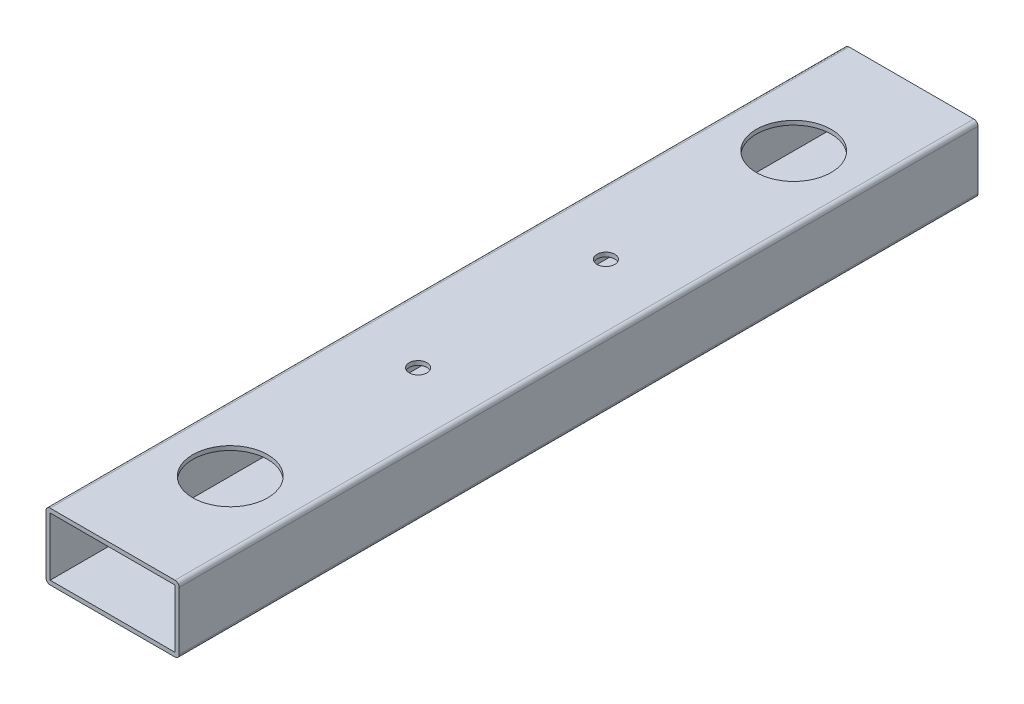
ISO-10303-21;
HEADER;
FILE_DESCRIPTION(('STEP AP214'),'2;1');
FILE_NAME('part.step','',(''),(''),'','','');
FILE_SCHEMA(('AUTOMOTIVE_DESIGN { 1 0 10303 214 1 1 1 1 }'));
ENDSEC;
DATA;
#1=APPLICATION_CONTEXT('core data for automotive mechanical design processes');
#2=APPLICATION_PROTOCOL_DEFINITION('international standard','automotive_design',2000,#1);
#3=PRODUCT_CONTEXT('',#1,'mechanical');
#4=PRODUCT('Part','Part','',(#3));
#5=PRODUCT_RELATED_PRODUCT_CATEGORY('part','',(#4));
#6=PRODUCT_DEFINITION_FORMATION('','',#4);
#7=PRODUCT_DEFINITION_CONTEXT('part definition',#1,'design');
#8=PRODUCT_DEFINITION('design','',#6,#7);
#9=PRODUCT_DEFINITION_SHAPE('','',#8);
#10=(LENGTH_UNIT() NAMED_UNIT(*) SI_UNIT(.MILLI.,.METRE.));
#11=(NAMED_UNIT(*) PLANE_ANGLE_UNIT() SI_UNIT($,.RADIAN.));
#12=(NAMED_UNIT(*) SI_UNIT($,.STERADIAN.) SOLID_ANGLE_UNIT());
#13=UNCERTAINTY_MEASURE_WITH_UNIT(LENGTH_MEASURE(1.E-05),#10,'distance_accuracy_value','');
#14=(GEOMETRIC_REPRESENTATION_CONTEXT(3) GLOBAL_UNCERTAINTY_ASSIGNED_CONTEXT((#13)) GLOBAL_UNIT_ASSIGNED_CONTEXT((#10,
#11,#12)) REPRESENTATION_CONTEXT('',''));
#15=CARTESIAN_POINT('',(0.,0.,0.));
#16=DIRECTION('',(0.,0.,1.));
#17=DIRECTION('',(1.,0.,0.));
#18=AXIS2_PLACEMENT_3D('',#15,#16,#17);
#19=CARTESIAN_POINT('',(-23.8125,-11.1125,304.8));
#20=DIRECTION('',(0.,0.,-1.));
#21=DIRECTION('',(-1.,0.,0.));
#22=AXIS2_PLACEMENT_3D('',#19,#20,#21);
#23=PLANE('',#22);
#24=CARTESIAN_POINT('',(-23.8125,-11.1125,304.8));
#25=DIRECTION('',(0.,0.,1.));
#26=DIRECTION('',(-1.,0.,0.));
#27=AXIS2_PLACEMENT_3D('',#24,#25,#26);
#28=CIRCLE('',#27,1.5875);
#29=CARTESIAN_POINT('',(-25.4,-11.1125,304.8));
#30=VERTEX_POINT('',#29);
#31=CARTESIAN_POINT('',(-23.8125,-12.7,304.8));
#32=VERTEX_POINT('',#31);
#33=EDGE_CURVE('E160',#30,#32,#28,.T.);
#34=ORIENTED_EDGE('',*,*,#33,.T.);
#35=DIRECTION('',(1.,0.,0.));
#36=VECTOR('',#35,1.);
#37=CARTESIAN_POINT('',(-23.8125,-12.7,304.8));
#38=LINE('',#37,#36);
#39=CARTESIAN_POINT('',(23.8125,-12.7,304.8));
#40=VERTEX_POINT('',#39);
#41=EDGE_CURVE('E163',#32,#40,#38,.T.);
#42=ORIENTED_EDGE('',*,*,#41,.T.);
#43=CARTESIAN_POINT('',(23.8125,-11.1125,304.8));
#44=DIRECTION('',(0.,0.,1.));
#45=DIRECTION('',(1.,0.,0.));
#46=AXIS2_PLACEMENT_3D('',#43,#44,#45);
#47=CIRCLE('',#46,1.5875);
#48=CARTESIAN_POINT('',(25.4,-11.1125,304.8));
#49=VERTEX_POINT('',#48);
#50=EDGE_CURVE('E166',#40,#49,#47,.T.);
#51=ORIENTED_EDGE('',*,*,#50,.T.);
#52=DIRECTION('',(0.,1.,0.));
#53=VECTOR('',#52,1.);
#54=CARTESIAN_POINT('',(25.4,-11.1125,304.8));
#55=LINE('',#54,#53);
#56=CARTESIAN_POINT('',(25.4,11.1125,304.8));
#57=VERTEX_POINT('',#56);
#58=EDGE_CURVE('E168',#49,#57,#55,.T.);
#59=ORIENTED_EDGE('',*,*,#58,.T.);
#60=CARTESIAN_POINT('',(23.8125,11.1125,304.8));
#61=DIRECTION('',(0.,0.,1.));
#62=DIRECTION('',(-1.,0.,0.));
#63=AXIS2_PLACEMENT_3D('',#60,#61,#62);
#64=CIRCLE('',#63,1.5875);
#65=CARTESIAN_POINT('',(23.8125,12.7,304.8));
#66=VERTEX_POINT('',#65);
#67=EDGE_CURVE('E170',#57,#66,#64,.T.);
#68=ORIENTED_EDGE('',*,*,#67,.T.);
#69=DIRECTION('',(-1.,0.,0.));
#70=VECTOR('',#69,1.);
#71=CARTESIAN_POINT('',(-23.8125,12.7,304.8));
#72=LINE('',#71,#70);
#73=CARTESIAN_POINT('',(-23.8125,12.7,304.8));
#74=VERTEX_POINT('',#73);
#75=EDGE_CURVE('E172',#66,#74,#72,.T.);
#76=ORIENTED_EDGE('',*,*,#75,.T.);
#77=CARTESIAN_POINT('',(-23.8125,11.1125,304.8));
#78=DIRECTION('',(0.,0.,1.));
#79=DIRECTION('',(-1.,0.,0.));
#80=AXIS2_PLACEMENT_3D('',#77,#78,#79);
#81=CIRCLE('',#80,1.5875);
#82=CARTESIAN_POINT('',(-25.4,11.1125,304.8));
#83=VERTEX_POINT('',#82);
#84=EDGE_CURVE('E174',#74,#83,#81,.T.);
#85=ORIENTED_EDGE('',*,*,#84,.T.);
#86=DIRECTION('',(0.,-1.,0.));
#87=VECTOR('',#86,1.);
#88=CARTESIAN_POINT('',(-25.4,-11.1125,304.8));
#89=LINE('',#88,#87);
#90=EDGE_CURVE('E176',#83,#30,#89,.T.);
#91=ORIENTED_EDGE('',*,*,#90,.T.);
#92=EDGE_LOOP('',(#34,#42,#51,#59,#68,#76,#85,#91));
#93=FACE_BOUND('',#92,.T.);
#94=DIRECTION('',(0.,-1.,0.));
#95=VECTOR('',#94,1.);
#96=CARTESIAN_POINT('',(-23.8125,-11.1125,304.8));
#97=LINE('',#96,#95);
#98=CARTESIAN_POINT('',(-23.8125,11.1125,304.8));
#99=VERTEX_POINT('',#98);
#100=CARTESIAN_POINT('',(-23.8125,-11.1125,304.8));
#101=VERTEX_POINT('',#100);
#102=EDGE_CURVE('E122',#99,#101,#97,.T.);
#103=ORIENTED_EDGE('',*,*,#102,.F.);
#104=DIRECTION('',(-1.,0.,0.));
#105=VECTOR('',#104,1.);
#106=CARTESIAN_POINT('',(-23.8125,11.1125,304.8));
#107=LINE('',#106,#105);
#108=CARTESIAN_POINT('',(23.8125,11.1125,304.8));
#109=VERTEX_POINT('',#108);
#110=EDGE_CURVE('E144',#109,#99,#107,.T.);
#111=ORIENTED_EDGE('',*,*,#110,.F.);
#112=DIRECTION('',(0.,1.,0.));
#113=VECTOR('',#112,1.);
#114=CARTESIAN_POINT('',(23.8125,-11.1125,304.8));
#115=LINE('',#114,#113);
#116=CARTESIAN_POINT('',(23.8125,-11.1125,304.8));
#117=VERTEX_POINT('',#116);
#118=EDGE_CURVE('E142',#117,#109,#115,.T.);
#119=ORIENTED_EDGE('',*,*,#118,.F.);
#120=DIRECTION('',(1.,0.,0.));
#121=VECTOR('',#120,1.);
#122=CARTESIAN_POINT('',(-23.8125,-11.1125,304.8));
#123=LINE('',#122,#121);
#124=EDGE_CURVE('E130',#101,#117,#123,.T.);
#125=ORIENTED_EDGE('',*,*,#124,.F.);
#126=EDGE_LOOP('',(#103,#111,#119,#125));
#127=FACE_BOUND('',#126,.T.);
#128=ADVANCED_FACE('F33',(#93,#127),#23,.F.);
#129=CARTESIAN_POINT('',(-23.8125,-11.1125,0.));
#130=DIRECTION('',(0.,0.,-1.));
#131=DIRECTION('',(-1.,0.,0.));
#132=AXIS2_PLACEMENT_3D('',#129,#130,#131);
#133=PLANE('',#132);
#134=CARTESIAN_POINT('',(-23.8125,-11.1125,0.));
#135=DIRECTION('',(0.,0.,1.));
#136=DIRECTION('',(-1.,0.,0.));
#137=AXIS2_PLACEMENT_3D('',#134,#135,#136);
#138=CIRCLE('',#137,1.5875);
#139=CARTESIAN_POINT('',(-25.4,-11.1125,0.));
#140=VERTEX_POINT('',#139);
#141=CARTESIAN_POINT('',(-23.8125,-12.7,0.));
#142=VERTEX_POINT('',#141);
#143=EDGE_CURVE('E138',#140,#142,#138,.T.);
#144=ORIENTED_EDGE('',*,*,#143,.F.);
#145=DIRECTION('',(0.,-1.,0.));
#146=VECTOR('',#145,1.);
#147=CARTESIAN_POINT('',(-25.4,-11.1125,0.));
#148=LINE('',#147,#146);
#149=CARTESIAN_POINT('',(-25.4,11.1125,0.));
#150=VERTEX_POINT('',#149);
#151=EDGE_CURVE('E164',#150,#140,#148,.T.);
#152=ORIENTED_EDGE('',*,*,#151,.F.);
#153=CARTESIAN_POINT('',(-23.8125,11.1125,0.));
#154=DIRECTION('',(0.,0.,1.));
#155=DIRECTION('',(-1.,0.,0.));
#156=AXIS2_PLACEMENT_3D('',#153,#154,#155);
#157=CIRCLE('',#156,1.5875);
#158=CARTESIAN_POINT('',(-23.8125,12.7,0.));
#159=VERTEX_POINT('',#158);
#160=EDGE_CURVE('E191',#159,#150,#157,.T.);
#161=ORIENTED_EDGE('',*,*,#160,.F.);
#162=DIRECTION('',(-1.,0.,0.));
#163=VECTOR('',#162,1.);
#164=CARTESIAN_POINT('',(-23.8125,12.7,0.));
#165=LINE('',#164,#163);
#166=CARTESIAN_POINT('',(23.8125,12.7,0.));
#167=VERTEX_POINT('',#166);
#168=EDGE_CURVE('E189',#167,#159,#165,.T.);
#169=ORIENTED_EDGE('',*,*,#168,.F.);
#170=CARTESIAN_POINT('',(23.8125,11.1125,0.));
#171=DIRECTION('',(0.,0.,1.));
#172=DIRECTION('',(-1.,0.,0.));
#173=AXIS2_PLACEMENT_3D('',#170,#171,#172);
#174=CIRCLE('',#173,1.5875);
#175=CARTESIAN_POINT('',(25.4,11.1125,0.));
#176=VERTEX_POINT('',#175);
#177=EDGE_CURVE('E187',#176,#167,#174,.T.);
#178=ORIENTED_EDGE('',*,*,#177,.F.);
#179=DIRECTION('',(0.,1.,0.));
#180=VECTOR('',#179,1.);
#181=CARTESIAN_POINT('',(25.4,-11.1125,0.));
#182=LINE('',#181,#180);
#183=CARTESIAN_POINT('',(25.4,-11.1125,0.));
#184=VERTEX_POINT('',#183);
#185=EDGE_CURVE('E185',#184,#176,#182,.T.);
#186=ORIENTED_EDGE('',*,*,#185,.F.);
#187=CARTESIAN_POINT('',(23.8125,-11.1125,0.));
#188=DIRECTION('',(0.,0.,1.));
#189=DIRECTION('',(1.,0.,0.));
#190=AXIS2_PLACEMENT_3D('',#187,#188,#189);
#191=CIRCLE('',#190,1.5875);
#192=CARTESIAN_POINT('',(23.8125,-12.7,0.));
#193=VERTEX_POINT('',#192);
#194=EDGE_CURVE('E183',#193,#184,#191,.T.);
#195=ORIENTED_EDGE('',*,*,#194,.F.);
#196=DIRECTION('',(1.,0.,0.));
#197=VECTOR('',#196,1.);
#198=CARTESIAN_POINT('',(-23.8125,-12.7,0.));
#199=LINE('',#198,#197);
#200=EDGE_CURVE('E181',#142,#193,#199,.T.);
#201=ORIENTED_EDGE('',*,*,#200,.F.);
#202=EDGE_LOOP('',(#144,#152,#161,#169,#178,#186,#195,#201));
#203=FACE_BOUND('',#202,.T.);
#204=DIRECTION('',(-1.,0.,0.));
#205=VECTOR('',#204,1.);
#206=CARTESIAN_POINT('',(-23.8125,11.1125,0.));
#207=LINE('',#206,#205);
#208=CARTESIAN_POINT('',(23.8125,11.1125,0.));
#209=VERTEX_POINT('',#208);
#210=CARTESIAN_POINT('',(-23.8125,11.1125,0.));
#211=VERTEX_POINT('',#210);
#212=EDGE_CURVE('E131',#209,#211,#207,.T.);
#213=ORIENTED_EDGE('',*,*,#212,.T.);
#214=DIRECTION('',(0.,-1.,0.));
#215=VECTOR('',#214,1.);
#216=CARTESIAN_POINT('',(-23.8125,-11.1125,0.));
#217=LINE('',#216,#215);
#218=CARTESIAN_POINT('',(-23.8125,-11.1125,0.));
#219=VERTEX_POINT('',#218);
#220=EDGE_CURVE('E56',#211,#219,#217,.T.);
#221=ORIENTED_EDGE('',*,*,#220,.T.);
#222=DIRECTION('',(1.,0.,0.));
#223=VECTOR('',#222,1.);
#224=CARTESIAN_POINT('',(-23.8125,-11.1125,0.));
#225=LINE('',#224,#223);
#226=CARTESIAN_POINT('',(23.8125,-11.1125,0.));
#227=VERTEX_POINT('',#226);
#228=EDGE_CURVE('E137',#219,#227,#225,.T.);
#229=ORIENTED_EDGE('',*,*,#228,.T.);
#230=DIRECTION('',(0.,1.,0.));
#231=VECTOR('',#230,1.);
#232=CARTESIAN_POINT('',(23.8125,-11.1125,0.));
#233=LINE('',#232,#231);
#234=EDGE_CURVE('E152',#227,#209,#233,.T.);
#235=ORIENTED_EDGE('',*,*,#234,.T.);
#236=EDGE_LOOP('',(#213,#221,#229,#235));
#237=FACE_BOUND('',#236,.T.);
#238=ADVANCED_FACE('F221',(#203,#237),#133,.T.);
#239=CARTESIAN_POINT('',(-23.8125,-11.1125,304.8));
#240=DIRECTION('',(0.,0.,-1.));
#241=DIRECTION('',(-1.,0.,0.));
#242=AXIS2_PLACEMENT_3D('',#239,#240,#241);
#243=CYLINDRICAL_SURFACE('',#242,1.5875);
#244=ORIENTED_EDGE('',*,*,#143,.T.);
#245=DIRECTION('',(0.,0.,-1.));
#246=VECTOR('',#245,1.);
#247=CARTESIAN_POINT('',(-23.8125,-12.7,304.8));
#248=LINE('',#247,#246);
#249=EDGE_CURVE('E11',#32,#142,#248,.T.);
#250=ORIENTED_EDGE('',*,*,#249,.F.);
#251=ORIENTED_EDGE('',*,*,#33,.F.);
#252=DIRECTION('',(0.,0.,-1.));
#253=VECTOR('',#252,1.);
#254=CARTESIAN_POINT('',(-25.4,-11.1125,304.8));
#255=LINE('',#254,#253);
#256=EDGE_CURVE('E178',#30,#140,#255,.T.);
#257=ORIENTED_EDGE('',*,*,#256,.T.);
#258=EDGE_LOOP('',(#244,#250,#251,#257));
#259=FACE_BOUND('',#258,.T.);
#260=ADVANCED_FACE('F35',(#259),#243,.T.);
#261=CARTESIAN_POINT('',(-23.8125,-12.7,304.8));
#262=DIRECTION('',(0.,1.,0.));
#263=DIRECTION('',(0.,0.,1.));
#264=AXIS2_PLACEMENT_3D('',#261,#262,#263);
#265=PLANE('',#264);
#266=CARTESIAN_POINT('',(0.,-12.7,116.566667171));
#267=DIRECTION('',(0.,1.,0.));
#268=DIRECTION('',(0.,0.,1.));
#269=AXIS2_PLACEMENT_3D('',#266,#267,#268);
#270=CIRCLE('',#269,7.9375);
#271=CARTESIAN_POINT('',(0.,-12.7,124.504167171));
#272=VERTEX_POINT('',#271);
#273=EDGE_CURVE('E331',#272,#272,#270,.F.);
#274=ORIENTED_EDGE('',*,*,#273,.F.);
#275=EDGE_LOOP('',(#274));
#276=FACE_BOUND('',#275,.T.);
#277=CARTESIAN_POINT('',(0.,-12.7,188.233332829));
#278=DIRECTION('',(0.,1.,0.));
#279=DIRECTION('',(0.,0.,1.));
#280=AXIS2_PLACEMENT_3D('',#277,#278,#279);
#281=CIRCLE('',#280,7.93749999999999);
#282=CARTESIAN_POINT('',(0.,-12.7,196.170832829));
#283=VERTEX_POINT('',#282);
#284=EDGE_CURVE('E334',#283,#283,#281,.F.);
#285=ORIENTED_EDGE('',*,*,#284,.F.);
#286=EDGE_LOOP('',(#285));
#287=FACE_BOUND('',#286,.T.);
#288=CARTESIAN_POINT('',(0.,-12.7,44.899999989));
#289=DIRECTION('',(0.,1.,0.));
#290=DIRECTION('',(0.,0.,1.));
#291=AXIS2_PLACEMENT_3D('',#288,#289,#290);
#292=CIRCLE('',#291,12.7);
#293=CARTESIAN_POINT('',(0.,-12.7,57.599999989));
#294=VERTEX_POINT('',#293);
#295=EDGE_CURVE('E360',#294,#294,#292,.F.);
#296=ORIENTED_EDGE('',*,*,#295,.F.);
#297=EDGE_LOOP('',(#296));
#298=FACE_BOUND('',#297,.T.);
#299=CARTESIAN_POINT('',(0.,-12.7,259.900000011));
#300=DIRECTION('',(0.,1.,0.));
#301=DIRECTION('',(0.,0.,1.));
#302=AXIS2_PLACEMENT_3D('',#299,#300,#301);
#303=CIRCLE('',#302,12.7);
#304=CARTESIAN_POINT('',(0.,-12.7,272.600000011));
#305=VERTEX_POINT('',#304);
#306=EDGE_CURVE('E355',#305,#305,#303,.F.);
#307=ORIENTED_EDGE('',*,*,#306,.F.);
#308=EDGE_LOOP('',(#307));
#309=FACE_BOUND('',#308,.T.);
#310=ORIENTED_EDGE('',*,*,#200,.T.);
#311=DIRECTION('',(0.,0.,-1.));
#312=VECTOR('',#311,1.);
#313=CARTESIAN_POINT('',(23.8125,-12.7,304.8));
#314=LINE('',#313,#312);
#315=EDGE_CURVE('E41',#40,#193,#314,.T.);
#316=ORIENTED_EDGE('',*,*,#315,.F.);
#317=ORIENTED_EDGE('',*,*,#41,.F.);
#318=ORIENTED_EDGE('',*,*,#249,.T.);
#319=EDGE_LOOP('',(#310,#316,#317,#318));
#320=FACE_BOUND('',#319,.T.);
#321=ADVANCED_FACE('F238',(#276,#287,#298,#309,#320),#265,.F.);
#322=CARTESIAN_POINT('',(23.8125,-11.1125,304.8));
#323=DIRECTION('',(0.,0.,-1.));
#324=DIRECTION('',(-1.,0.,0.));
#325=AXIS2_PLACEMENT_3D('',#322,#323,#324);
#326=CYLINDRICAL_SURFACE('',#325,1.5875);
#327=ORIENTED_EDGE('',*,*,#194,.T.);
#328=DIRECTION('',(0.,0.,-1.));
#329=VECTOR('',#328,1.);
#330=CARTESIAN_POINT('',(25.4,-11.1125,304.8));
#331=LINE('',#330,#329);
#332=EDGE_CURVE('E208',#49,#184,#331,.T.);
#333=ORIENTED_EDGE('',*,*,#332,.F.);
#334=ORIENTED_EDGE('',*,*,#50,.F.);
#335=ORIENTED_EDGE('',*,*,#315,.T.);
#336=EDGE_LOOP('',(#327,#333,#334,#335));
#337=FACE_BOUND('',#336,.T.);
#338=ADVANCED_FACE('F215',(#337),#326,.T.);
#339=CARTESIAN_POINT('',(25.4,-11.1125,304.8));
#340=DIRECTION('',(-1.,0.,0.));
#341=DIRECTION('',(0.,0.,1.));
#342=AXIS2_PLACEMENT_3D('',#339,#340,#341);
#343=PLANE('',#342);
#344=ORIENTED_EDGE('',*,*,#185,.T.);
#345=DIRECTION('',(0.,0.,-1.));
#346=VECTOR('',#345,1.);
#347=CARTESIAN_POINT('',(25.4,11.1125,304.8));
#348=LINE('',#347,#346);
#349=EDGE_CURVE('E205',#57,#176,#348,.T.);
#350=ORIENTED_EDGE('',*,*,#349,.F.);
#351=ORIENTED_EDGE('',*,*,#58,.F.);
#352=ORIENTED_EDGE('',*,*,#332,.T.);
#353=EDGE_LOOP('',(#344,#350,#351,#352));
#354=FACE_BOUND('',#353,.T.);
#355=ADVANCED_FACE('F227',(#354),#343,.F.);
#356=CARTESIAN_POINT('',(23.8125,11.1125,304.8));
#357=DIRECTION('',(0.,0.,-1.));
#358=DIRECTION('',(-1.,0.,0.));
#359=AXIS2_PLACEMENT_3D('',#356,#357,#358);
#360=CYLINDRICAL_SURFACE('',#359,1.5875);
#361=ORIENTED_EDGE('',*,*,#177,.T.);
#362=DIRECTION('',(0.,0.,-1.));
#363=VECTOR('',#362,1.);
#364=CARTESIAN_POINT('',(23.8125,12.7,304.8));
#365=LINE('',#364,#363);
#366=EDGE_CURVE('E202',#66,#167,#365,.T.);
#367=ORIENTED_EDGE('',*,*,#366,.F.);
#368=ORIENTED_EDGE('',*,*,#67,.F.);
#369=ORIENTED_EDGE('',*,*,#349,.T.);
#370=EDGE_LOOP('',(#361,#367,#368,#369));
#371=FACE_BOUND('',#370,.T.);
#372=ADVANCED_FACE('F231',(#371),#360,.T.);
#373=CARTESIAN_POINT('',(-23.8125,12.7,304.8));
#374=DIRECTION('',(0.,-1.,0.));
#375=DIRECTION('',(0.,0.,-1.));
#376=AXIS2_PLACEMENT_3D('',#373,#374,#375);
#377=PLANE('',#376);
#378=CARTESIAN_POINT('',(0.,12.7,188.233332829));
#379=DIRECTION('',(0.,-1.,0.));
#380=DIRECTION('',(0.,0.,-1.));
#381=AXIS2_PLACEMENT_3D('',#378,#379,#380);
#382=CIRCLE('',#381,3.3782);
#383=CARTESIAN_POINT('',(0.,12.7,184.855132829));
#384=VERTEX_POINT('',#383);
#385=EDGE_CURVE('E348',#384,#384,#382,.F.);
#386=ORIENTED_EDGE('',*,*,#385,.F.);
#387=EDGE_LOOP('',(#386));
#388=FACE_BOUND('',#387,.T.);
#389=CARTESIAN_POINT('',(0.,12.7,116.566667171));
#390=DIRECTION('',(0.,-1.,0.));
#391=DIRECTION('',(0.,0.,-1.));
#392=AXIS2_PLACEMENT_3D('',#389,#390,#391);
#393=CIRCLE('',#392,3.3782);
#394=CARTESIAN_POINT('',(0.,12.7,113.188467171));
#395=VERTEX_POINT('',#394);
#396=EDGE_CURVE('E344',#395,#395,#393,.F.);
#397=ORIENTED_EDGE('',*,*,#396,.F.);
#398=EDGE_LOOP('',(#397));
#399=FACE_BOUND('',#398,.T.);
#400=CARTESIAN_POINT('',(0.,12.7,259.900000011));
#401=DIRECTION('',(0.,-1.,0.));
#402=DIRECTION('',(0.,0.,-1.));
#403=AXIS2_PLACEMENT_3D('',#400,#401,#402);
#404=CIRCLE('',#403,14.2875);
#405=CARTESIAN_POINT('',(0.,12.7,245.612500011));
#406=VERTEX_POINT('',#405);
#407=EDGE_CURVE('E150',#406,#406,#404,.F.);
#408=ORIENTED_EDGE('',*,*,#407,.F.);
#409=EDGE_LOOP('',(#408));
#410=FACE_BOUND('',#409,.T.);
#411=CARTESIAN_POINT('',(0.,12.7,44.899999989));
#412=DIRECTION('',(0.,-1.,0.));
#413=DIRECTION('',(0.,0.,-1.));
#414=AXIS2_PLACEMENT_3D('',#411,#412,#413);
#415=CIRCLE('',#414,14.2875);
#416=CARTESIAN_POINT('',(0.,12.7,30.612499989));
#417=VERTEX_POINT('',#416);
#418=EDGE_CURVE('E367',#417,#417,#415,.F.);
#419=ORIENTED_EDGE('',*,*,#418,.F.);
#420=EDGE_LOOP('',(#419));
#421=FACE_BOUND('',#420,.T.);
#422=ORIENTED_EDGE('',*,*,#168,.T.);
#423=DIRECTION('',(0.,0.,-1.));
#424=VECTOR('',#423,1.);
#425=CARTESIAN_POINT('',(-23.8125,12.7,304.8));
#426=LINE('',#425,#424);
#427=EDGE_CURVE('E199',#74,#159,#426,.T.);
#428=ORIENTED_EDGE('',*,*,#427,.F.);
#429=ORIENTED_EDGE('',*,*,#75,.F.);
#430=ORIENTED_EDGE('',*,*,#366,.T.);
#431=EDGE_LOOP('',(#422,#428,#429,#430));
#432=FACE_BOUND('',#431,.T.);
#433=ADVANCED_FACE('F251',(#388,#399,#410,#421,#432),#377,.F.);
#434=CARTESIAN_POINT('',(-23.8125,11.1125,304.8));
#435=DIRECTION('',(0.,0.,-1.));
#436=DIRECTION('',(-1.,0.,0.));
#437=AXIS2_PLACEMENT_3D('',#434,#435,#436);
#438=CYLINDRICAL_SURFACE('',#437,1.5875);
#439=ORIENTED_EDGE('',*,*,#160,.T.);
#440=DIRECTION('',(0.,0.,-1.));
#441=VECTOR('',#440,1.);
#442=CARTESIAN_POINT('',(-25.4,11.1125,304.8));
#443=LINE('',#442,#441);
#444=EDGE_CURVE('E196',#83,#150,#443,.T.);
#445=ORIENTED_EDGE('',*,*,#444,.F.);
#446=ORIENTED_EDGE('',*,*,#84,.F.);
#447=ORIENTED_EDGE('',*,*,#427,.T.);
#448=EDGE_LOOP('',(#439,#445,#446,#447));
#449=FACE_BOUND('',#448,.T.);
#450=ADVANCED_FACE('F249',(#449),#438,.T.);
#451=CARTESIAN_POINT('',(-25.4,-11.1125,304.8));
#452=DIRECTION('',(1.,0.,0.));
#453=DIRECTION('',(0.,0.,-1.));
#454=AXIS2_PLACEMENT_3D('',#451,#452,#453);
#455=PLANE('',#454);
#456=ORIENTED_EDGE('',*,*,#151,.T.);
#457=ORIENTED_EDGE('',*,*,#256,.F.);
#458=ORIENTED_EDGE('',*,*,#90,.F.);
#459=ORIENTED_EDGE('',*,*,#444,.T.);
#460=EDGE_LOOP('',(#456,#457,#458,#459));
#461=FACE_BOUND('',#460,.T.);
#462=ADVANCED_FACE('F244',(#461),#455,.F.);
#463=CARTESIAN_POINT('',(-23.8125,-11.1125,304.8));
#464=DIRECTION('',(1.,0.,0.));
#465=DIRECTION('',(0.,0.,-1.));
#466=AXIS2_PLACEMENT_3D('',#463,#464,#465);
#467=PLANE('',#466);
#468=ORIENTED_EDGE('',*,*,#220,.F.);
#469=DIRECTION('',(0.,0.,-1.));
#470=VECTOR('',#469,1.);
#471=CARTESIAN_POINT('',(-23.8125,11.1125,304.8));
#472=LINE('',#471,#470);
#473=EDGE_CURVE('E126',#99,#211,#472,.T.);
#474=ORIENTED_EDGE('',*,*,#473,.F.);
#475=ORIENTED_EDGE('',*,*,#102,.T.);
#476=DIRECTION('',(0.,0.,-1.));
#477=VECTOR('',#476,1.);
#478=CARTESIAN_POINT('',(-23.8125,-11.1125,304.8));
#479=LINE('',#478,#477);
#480=EDGE_CURVE('E125',#101,#219,#479,.T.);
#481=ORIENTED_EDGE('',*,*,#480,.T.);
#482=EDGE_LOOP('',(#468,#474,#475,#481));
#483=FACE_BOUND('',#482,.T.);
#484=ADVANCED_FACE('F124',(#483),#467,.T.);
#485=CARTESIAN_POINT('',(-23.8125,-11.1125,304.8));
#486=DIRECTION('',(0.,1.,0.));
#487=DIRECTION('',(0.,0.,1.));
#488=AXIS2_PLACEMENT_3D('',#485,#486,#487);
#489=PLANE('',#488);
#490=CARTESIAN_POINT('',(0.,-11.1125,116.566667171));
#491=DIRECTION('',(0.,1.,0.));
#492=DIRECTION('',(0.,0.,1.));
#493=AXIS2_PLACEMENT_3D('',#490,#491,#492);
#494=CIRCLE('',#493,7.9375);
#495=CARTESIAN_POINT('',(0.,-11.1125,124.504167171));
#496=VERTEX_POINT('',#495);
#497=EDGE_CURVE('E328',#496,#496,#494,.F.);
#498=ORIENTED_EDGE('',*,*,#497,.T.);
#499=EDGE_LOOP('',(#498));
#500=FACE_BOUND('',#499,.T.);
#501=CARTESIAN_POINT('',(0.,-11.1125,188.233332829));
#502=DIRECTION('',(0.,1.,0.));
#503=DIRECTION('',(0.,0.,1.));
#504=AXIS2_PLACEMENT_3D('',#501,#502,#503);
#505=CIRCLE('',#504,7.93749999999999);
#506=CARTESIAN_POINT('',(0.,-11.1125,196.170832829));
#507=VERTEX_POINT('',#506);
#508=EDGE_CURVE('E528',#507,#507,#505,.F.);
#509=ORIENTED_EDGE('',*,*,#508,.T.);
#510=EDGE_LOOP('',(#509));
#511=FACE_BOUND('',#510,.T.);
#512=CARTESIAN_POINT('',(0.,-11.1125,44.899999989));
#513=DIRECTION('',(0.,1.,0.));
#514=DIRECTION('',(0.,0.,1.));
#515=AXIS2_PLACEMENT_3D('',#512,#513,#514);
#516=CIRCLE('',#515,12.7);
#517=CARTESIAN_POINT('',(0.,-11.1125,57.599999989));
#518=VERTEX_POINT('',#517);
#519=EDGE_CURVE('E352',#518,#518,#516,.F.);
#520=ORIENTED_EDGE('',*,*,#519,.T.);
#521=EDGE_LOOP('',(#520));
#522=FACE_BOUND('',#521,.T.);
#523=CARTESIAN_POINT('',(0.,-11.1125,259.900000011));
#524=DIRECTION('',(0.,1.,0.));
#525=DIRECTION('',(0.,0.,1.));
#526=AXIS2_PLACEMENT_3D('',#523,#524,#525);
#527=CIRCLE('',#526,12.7);
#528=CARTESIAN_POINT('',(0.,-11.1125,272.600000011));
#529=VERTEX_POINT('',#528);
#530=EDGE_CURVE('E351',#529,#529,#527,.F.);
#531=ORIENTED_EDGE('',*,*,#530,.T.);
#532=EDGE_LOOP('',(#531));
#533=FACE_BOUND('',#532,.T.);
#534=ORIENTED_EDGE('',*,*,#228,.F.);
#535=ORIENTED_EDGE('',*,*,#480,.F.);
#536=ORIENTED_EDGE('',*,*,#124,.T.);
#537=DIRECTION('',(0.,0.,-1.));
#538=VECTOR('',#537,1.);
#539=CARTESIAN_POINT('',(23.8125,-11.1125,304.8));
#540=LINE('',#539,#538);
#541=EDGE_CURVE('E139',#117,#227,#540,.T.);
#542=ORIENTED_EDGE('',*,*,#541,.T.);
#543=EDGE_LOOP('',(#534,#535,#536,#542));
#544=FACE_BOUND('',#543,.T.);
#545=ADVANCED_FACE('F134',(#500,#511,#522,#533,#544),#489,.T.);
#546=CARTESIAN_POINT('',(23.8125,-11.1125,304.8));
#547=DIRECTION('',(-1.,0.,0.));
#548=DIRECTION('',(0.,-1.,0.));
#549=AXIS2_PLACEMENT_3D('',#546,#547,#548);
#550=PLANE('',#549);
#551=ORIENTED_EDGE('',*,*,#234,.F.);
#552=ORIENTED_EDGE('',*,*,#541,.F.);
#553=ORIENTED_EDGE('',*,*,#118,.T.);
#554=DIRECTION('',(0.,0.,-1.));
#555=VECTOR('',#554,1.);
#556=CARTESIAN_POINT('',(23.8125,11.1125,304.8));
#557=LINE('',#556,#555);
#558=EDGE_CURVE('E48',#109,#209,#557,.T.);
#559=ORIENTED_EDGE('',*,*,#558,.T.);
#560=EDGE_LOOP('',(#551,#552,#553,#559));
#561=FACE_BOUND('',#560,.T.);
#562=ADVANCED_FACE('F279',(#561),#550,.T.);
#563=CARTESIAN_POINT('',(-23.8125,11.1125,304.8));
#564=DIRECTION('',(0.,-1.,0.));
#565=DIRECTION('',(1.,0.,0.));
#566=AXIS2_PLACEMENT_3D('',#563,#564,#565);
#567=PLANE('',#566);
#568=CARTESIAN_POINT('',(0.,11.1125,188.233332829));
#569=DIRECTION('',(0.,-1.,0.));
#570=DIRECTION('',(1.,0.,0.));
#571=AXIS2_PLACEMENT_3D('',#568,#569,#570);
#572=CIRCLE('',#571,3.3782);
#573=CARTESIAN_POINT('',(3.37820000000001,11.1125,188.233332829));
#574=VERTEX_POINT('',#573);
#575=EDGE_CURVE('E337',#574,#574,#572,.F.);
#576=ORIENTED_EDGE('',*,*,#575,.T.);
#577=EDGE_LOOP('',(#576));
#578=FACE_BOUND('',#577,.T.);
#579=CARTESIAN_POINT('',(0.,11.1125,116.566667171));
#580=DIRECTION('',(0.,-1.,0.));
#581=DIRECTION('',(1.,0.,0.));
#582=AXIS2_PLACEMENT_3D('',#579,#580,#581);
#583=CIRCLE('',#582,3.3782);
#584=CARTESIAN_POINT('',(3.37820000000001,11.1125,116.566667171));
#585=VERTEX_POINT('',#584);
#586=EDGE_CURVE('E333',#585,#585,#583,.F.);
#587=ORIENTED_EDGE('',*,*,#586,.T.);
#588=EDGE_LOOP('',(#587));
#589=FACE_BOUND('',#588,.T.);
#590=CARTESIAN_POINT('',(0.,11.1125,259.900000011));
#591=DIRECTION('',(0.,-1.,0.));
#592=DIRECTION('',(1.,0.,0.));
#593=AXIS2_PLACEMENT_3D('',#590,#591,#592);
#594=CIRCLE('',#593,14.2875);
#595=CARTESIAN_POINT('',(14.2875,11.1125,259.900000011));
#596=VERTEX_POINT('',#595);
#597=EDGE_CURVE('E364',#596,#596,#594,.F.);
#598=ORIENTED_EDGE('',*,*,#597,.T.);
#599=EDGE_LOOP('',(#598));
#600=FACE_BOUND('',#599,.T.);
#601=CARTESIAN_POINT('',(0.,11.1125,44.899999989));
#602=DIRECTION('',(0.,-1.,0.));
#603=DIRECTION('',(1.,0.,0.));
#604=AXIS2_PLACEMENT_3D('',#601,#602,#603);
#605=CIRCLE('',#604,14.2875);
#606=CARTESIAN_POINT('',(14.2875,11.1125,44.899999989));
#607=VERTEX_POINT('',#606);
#608=EDGE_CURVE('E363',#607,#607,#605,.F.);
#609=ORIENTED_EDGE('',*,*,#608,.T.);
#610=EDGE_LOOP('',(#609));
#611=FACE_BOUND('',#610,.T.);
#612=ORIENTED_EDGE('',*,*,#212,.F.);
#613=ORIENTED_EDGE('',*,*,#558,.F.);
#614=ORIENTED_EDGE('',*,*,#110,.T.);
#615=ORIENTED_EDGE('',*,*,#473,.T.);
#616=EDGE_LOOP('',(#612,#613,#614,#615));
#617=FACE_BOUND('',#616,.T.);
#618=ADVANCED_FACE('F284',(#578,#589,#600,#611,#617),#567,.T.);
#619=CARTESIAN_POINT('',(0.,12.700012,44.899999989));
#620=DIRECTION('',(0.,-1.,0.));
#621=DIRECTION('',(0.,0.,-1.));
#622=AXIS2_PLACEMENT_3D('',#619,#620,#621);
#623=CYLINDRICAL_SURFACE('',#622,14.2875);
#624=ORIENTED_EDGE('',*,*,#608,.F.);
#625=EDGE_LOOP('',(#624));
#626=FACE_BOUND('',#625,.T.);
#627=ORIENTED_EDGE('',*,*,#418,.T.);
#628=EDGE_LOOP('',(#627));
#629=FACE_BOUND('',#628,.T.);
#630=ADVANCED_FACE('F292',(#626,#629),#623,.F.);
#631=CARTESIAN_POINT('',(0.,12.700012,259.900000011));
#632=DIRECTION('',(0.,-1.,0.));
#633=DIRECTION('',(0.,0.,-1.));
#634=AXIS2_PLACEMENT_3D('',#631,#632,#633);
#635=CYLINDRICAL_SURFACE('',#634,14.2875);
#636=ORIENTED_EDGE('',*,*,#597,.F.);
#637=EDGE_LOOP('',(#636));
#638=FACE_BOUND('',#637,.T.);
#639=ORIENTED_EDGE('',*,*,#407,.T.);
#640=EDGE_LOOP('',(#639));
#641=FACE_BOUND('',#640,.T.);
#642=ADVANCED_FACE('F296',(#638,#641),#635,.F.);
#643=CARTESIAN_POINT('',(0.,-12.700012,259.900000011));
#644=DIRECTION('',(0.,1.,0.));
#645=DIRECTION('',(0.,0.,1.));
#646=AXIS2_PLACEMENT_3D('',#643,#644,#645);
#647=CYLINDRICAL_SURFACE('',#646,12.7);
#648=ORIENTED_EDGE('',*,*,#530,.F.);
#649=EDGE_LOOP('',(#648));
#650=FACE_BOUND('',#649,.T.);
#651=ORIENTED_EDGE('',*,*,#306,.T.);
#652=EDGE_LOOP('',(#651));
#653=FACE_BOUND('',#652,.T.);
#654=ADVANCED_FACE('F300',(#650,#653),#647,.F.);
#655=CARTESIAN_POINT('',(0.,-12.700012,44.899999989));
#656=DIRECTION('',(0.,1.,0.));
#657=DIRECTION('',(0.,0.,1.));
#658=AXIS2_PLACEMENT_3D('',#655,#656,#657);
#659=CYLINDRICAL_SURFACE('',#658,12.7);
#660=ORIENTED_EDGE('',*,*,#519,.F.);
#661=EDGE_LOOP('',(#660));
#662=FACE_BOUND('',#661,.T.);
#663=ORIENTED_EDGE('',*,*,#295,.T.);
#664=EDGE_LOOP('',(#663));
#665=FACE_BOUND('',#664,.T.);
#666=ADVANCED_FACE('F304',(#662,#665),#659,.F.);
#667=CARTESIAN_POINT('',(0.,12.700012,116.566667171));
#668=DIRECTION('',(0.,-1.,0.));
#669=DIRECTION('',(0.,0.,-1.));
#670=AXIS2_PLACEMENT_3D('',#667,#668,#669);
#671=CYLINDRICAL_SURFACE('',#670,3.3782);
#672=ORIENTED_EDGE('',*,*,#586,.F.);
#673=EDGE_LOOP('',(#672));
#674=FACE_BOUND('',#673,.T.);
#675=ORIENTED_EDGE('',*,*,#396,.T.);
#676=EDGE_LOOP('',(#675));
#677=FACE_BOUND('',#676,.T.);
#678=ADVANCED_FACE('F308',(#674,#677),#671,.F.);
#679=CARTESIAN_POINT('',(0.,12.700012,188.233332829));
#680=DIRECTION('',(0.,-1.,0.));
#681=DIRECTION('',(0.,0.,-1.));
#682=AXIS2_PLACEMENT_3D('',#679,#680,#681);
#683=CYLINDRICAL_SURFACE('',#682,3.3782);
#684=ORIENTED_EDGE('',*,*,#575,.F.);
#685=EDGE_LOOP('',(#684));
#686=FACE_BOUND('',#685,.T.);
#687=ORIENTED_EDGE('',*,*,#385,.T.);
#688=EDGE_LOOP('',(#687));
#689=FACE_BOUND('',#688,.T.);
#690=ADVANCED_FACE('F312',(#686,#689),#683,.F.);
#691=CARTESIAN_POINT('',(0.,-12.700012,188.233332829));
#692=DIRECTION('',(0.,1.,0.));
#693=DIRECTION('',(0.,0.,1.));
#694=AXIS2_PLACEMENT_3D('',#691,#692,#693);
#695=CYLINDRICAL_SURFACE('',#694,7.93749999999999);
#696=ORIENTED_EDGE('',*,*,#508,.F.);
#697=EDGE_LOOP('',(#696));
#698=FACE_BOUND('',#697,.T.);
#699=ORIENTED_EDGE('',*,*,#284,.T.);
#700=EDGE_LOOP('',(#699));
#701=FACE_BOUND('',#700,.T.);
#702=ADVANCED_FACE('F316',(#698,#701),#695,.F.);
#703=CARTESIAN_POINT('',(0.,-12.700012,116.566667171));
#704=DIRECTION('',(0.,1.,0.));
#705=DIRECTION('',(0.,0.,1.));
#706=AXIS2_PLACEMENT_3D('',#703,#704,#705);
#707=CYLINDRICAL_SURFACE('',#706,7.9375);
#708=ORIENTED_EDGE('',*,*,#497,.F.);
#709=EDGE_LOOP('',(#708));
#710=FACE_BOUND('',#709,.T.);
#711=ORIENTED_EDGE('',*,*,#273,.T.);
#712=EDGE_LOOP('',(#711));
#713=FACE_BOUND('',#712,.T.);
#714=ADVANCED_FACE('F320',(#710,#713),#707,.F.);
#715=CLOSED_SHELL('',(#128,#238,#260,#321,#338,#355,#372,#433,#450,#462,#484,#545,#562,#618,
#630,#642,#654,#666,#678,#690,#702,#714));
#716=MANIFOLD_SOLID_BREP('B2',#715);
#717=ADVANCED_BREP_SHAPE_REPRESENTATION('',(#18,#716),#14);
#718=SHAPE_DEFINITION_REPRESENTATION(#9,#717);
ENDSEC;
END-ISO-10303-21;
